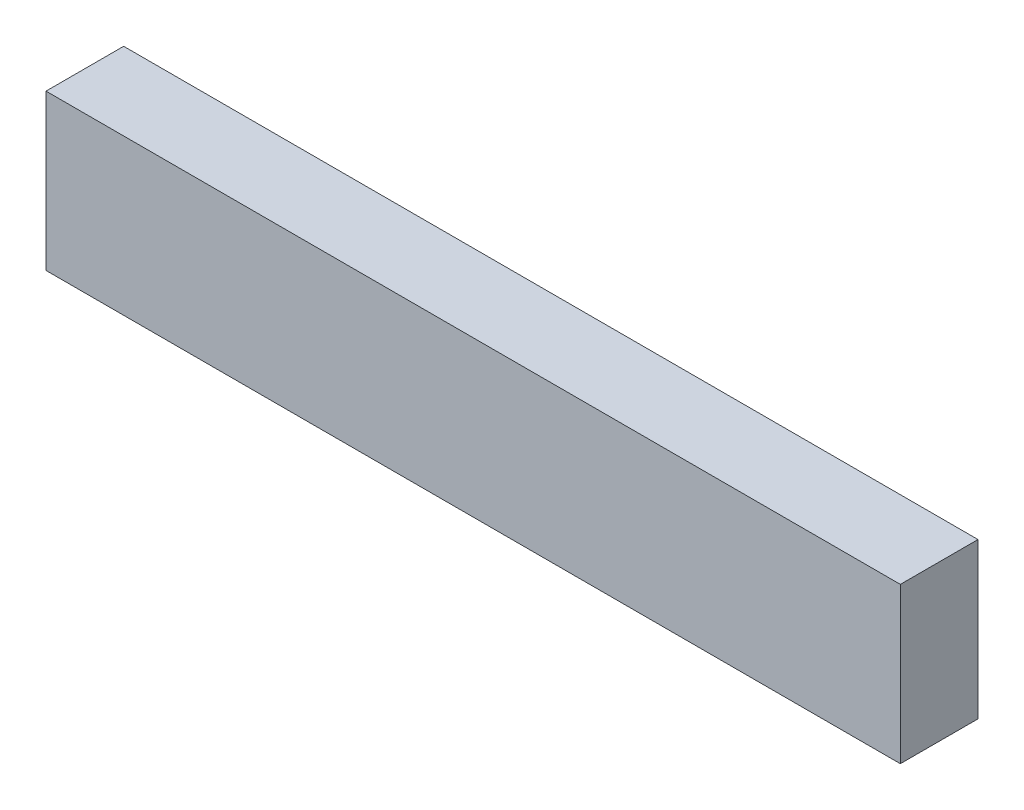
ISO-10303-21;
HEADER;
FILE_DESCRIPTION(('STEP AP214'),'2;1');
FILE_NAME('part.step','',(''),(''),'','','');
FILE_SCHEMA(('AUTOMOTIVE_DESIGN { 1 0 10303 214 1 1 1 1 }'));
ENDSEC;
DATA;
#1=APPLICATION_CONTEXT('core data for automotive mechanical design processes');
#2=APPLICATION_PROTOCOL_DEFINITION('international standard','automotive_design',2000,#1);
#3=PRODUCT_CONTEXT('',#1,'mechanical');
#4=PRODUCT('Part','Part','',(#3));
#5=PRODUCT_RELATED_PRODUCT_CATEGORY('part','',(#4));
#6=PRODUCT_DEFINITION_FORMATION('','',#4);
#7=PRODUCT_DEFINITION_CONTEXT('part definition',#1,'design');
#8=PRODUCT_DEFINITION('design','',#6,#7);
#9=PRODUCT_DEFINITION_SHAPE('','',#8);
#10=(LENGTH_UNIT() NAMED_UNIT(*) SI_UNIT(.MILLI.,.METRE.));
#11=(NAMED_UNIT(*) PLANE_ANGLE_UNIT() SI_UNIT($,.RADIAN.));
#12=(NAMED_UNIT(*) SI_UNIT($,.STERADIAN.) SOLID_ANGLE_UNIT());
#13=UNCERTAINTY_MEASURE_WITH_UNIT(LENGTH_MEASURE(1.E-05),#10,'distance_accuracy_value','');
#14=(GEOMETRIC_REPRESENTATION_CONTEXT(3) GLOBAL_UNCERTAINTY_ASSIGNED_CONTEXT((#13)) GLOBAL_UNIT_ASSIGNED_CONTEXT((#10,
#11,#12)) REPRESENTATION_CONTEXT('',''));
#15=CARTESIAN_POINT('',(0.,0.,0.));
#16=DIRECTION('',(0.,0.,1.));
#17=DIRECTION('',(1.,0.,0.));
#18=AXIS2_PLACEMENT_3D('',#15,#16,#17);
#19=CARTESIAN_POINT('',(0.,0.,10.));
#20=DIRECTION('',(1.,0.,0.));
#21=DIRECTION('',(0.,1.,0.));
#22=AXIS2_PLACEMENT_3D('',#19,#20,#21);
#23=PLANE('',#22);
#24=DIRECTION('',(0.,-1.,0.));
#25=VECTOR('',#24,1.);
#26=CARTESIAN_POINT('',(0.,0.,0.));
#27=LINE('',#26,#25);
#28=CARTESIAN_POINT('',(0.,0.,0.));
#29=VERTEX_POINT('',#28);
#30=CARTESIAN_POINT('',(0.,-20.,0.));
#31=VERTEX_POINT('',#30);
#32=EDGE_CURVE('E96',#29,#31,#27,.T.);
#33=ORIENTED_EDGE('',*,*,#32,.T.);
#34=DIRECTION('',(0.,0.,-1.));
#35=VECTOR('',#34,1.);
#36=CARTESIAN_POINT('',(0.,-20.,10.));
#37=LINE('',#36,#35);
#38=CARTESIAN_POINT('',(0.,-20.,10.));
#39=VERTEX_POINT('',#38);
#40=EDGE_CURVE('E11',#39,#31,#37,.T.);
#41=ORIENTED_EDGE('',*,*,#40,.F.);
#42=DIRECTION('',(0.,-1.,0.));
#43=VECTOR('',#42,1.);
#44=CARTESIAN_POINT('',(0.,0.,10.));
#45=LINE('',#44,#43);
#46=CARTESIAN_POINT('',(0.,0.,10.));
#47=VERTEX_POINT('',#46);
#48=EDGE_CURVE('E84',#47,#39,#45,.T.);
#49=ORIENTED_EDGE('',*,*,#48,.F.);
#50=DIRECTION('',(0.,0.,-1.));
#51=VECTOR('',#50,1.);
#52=CARTESIAN_POINT('',(0.,0.,10.));
#53=LINE('',#52,#51);
#54=EDGE_CURVE('E92',#47,#29,#53,.T.);
#55=ORIENTED_EDGE('',*,*,#54,.T.);
#56=EDGE_LOOP('',(#33,#41,#49,#55));
#57=FACE_BOUND('',#56,.T.);
#58=ADVANCED_FACE('F33',(#57),#23,.F.);
#59=CARTESIAN_POINT('',(0.,-20.,10.));
#60=DIRECTION('',(0.,1.,0.));
#61=DIRECTION('',(0.,0.,1.));
#62=AXIS2_PLACEMENT_3D('',#59,#60,#61);
#63=PLANE('',#62);
#64=DIRECTION('',(1.,0.,0.));
#65=VECTOR('',#64,1.);
#66=CARTESIAN_POINT('',(0.,-20.,0.));
#67=LINE('',#66,#65);
#68=CARTESIAN_POINT('',(110.,-20.,0.));
#69=VERTEX_POINT('',#68);
#70=EDGE_CURVE('E88',#31,#69,#67,.T.);
#71=ORIENTED_EDGE('',*,*,#70,.T.);
#72=DIRECTION('',(0.,0.,-1.));
#73=VECTOR('',#72,1.);
#74=CARTESIAN_POINT('',(110.,-20.,10.));
#75=LINE('',#74,#73);
#76=CARTESIAN_POINT('',(110.,-20.,10.));
#77=VERTEX_POINT('',#76);
#78=EDGE_CURVE('E41',#77,#69,#75,.T.);
#79=ORIENTED_EDGE('',*,*,#78,.F.);
#80=DIRECTION('',(1.,0.,0.));
#81=VECTOR('',#80,1.);
#82=CARTESIAN_POINT('',(0.,-20.,10.));
#83=LINE('',#82,#81);
#84=EDGE_CURVE('E79',#39,#77,#83,.T.);
#85=ORIENTED_EDGE('',*,*,#84,.F.);
#86=ORIENTED_EDGE('',*,*,#40,.T.);
#87=EDGE_LOOP('',(#71,#79,#85,#86));
#88=FACE_BOUND('',#87,.T.);
#89=ADVANCED_FACE('F87',(#88),#63,.F.);
#90=CARTESIAN_POINT('',(110.,0.,10.));
#91=DIRECTION('',(-1.,0.,0.));
#92=DIRECTION('',(0.,0.,1.));
#93=AXIS2_PLACEMENT_3D('',#90,#91,#92);
#94=PLANE('',#93);
#95=DIRECTION('',(0.,1.,0.));
#96=VECTOR('',#95,1.);
#97=CARTESIAN_POINT('',(110.,0.,0.));
#98=LINE('',#97,#96);
#99=CARTESIAN_POINT('',(110.,0.,0.));
#100=VERTEX_POINT('',#99);
#101=EDGE_CURVE('E66',#69,#100,#98,.T.);
#102=ORIENTED_EDGE('',*,*,#101,.T.);
#103=DIRECTION('',(0.,0.,-1.));
#104=VECTOR('',#103,1.);
#105=CARTESIAN_POINT('',(110.,0.,10.));
#106=LINE('',#105,#104);
#107=CARTESIAN_POINT('',(110.,0.,10.));
#108=VERTEX_POINT('',#107);
#109=EDGE_CURVE('E89',#108,#100,#106,.T.);
#110=ORIENTED_EDGE('',*,*,#109,.F.);
#111=DIRECTION('',(0.,1.,0.));
#112=VECTOR('',#111,1.);
#113=CARTESIAN_POINT('',(110.,0.,10.));
#114=LINE('',#113,#112);
#115=EDGE_CURVE('E82',#77,#108,#114,.T.);
#116=ORIENTED_EDGE('',*,*,#115,.F.);
#117=ORIENTED_EDGE('',*,*,#78,.T.);
#118=EDGE_LOOP('',(#102,#110,#116,#117));
#119=FACE_BOUND('',#118,.T.);
#120=ADVANCED_FACE('F90',(#119),#94,.F.);
#121=CARTESIAN_POINT('',(0.,0.,10.));
#122=DIRECTION('',(0.,-1.,0.));
#123=DIRECTION('',(0.,0.,-1.));
#124=AXIS2_PLACEMENT_3D('',#121,#122,#123);
#125=PLANE('',#124);
#126=DIRECTION('',(-1.,0.,0.));
#127=VECTOR('',#126,1.);
#128=CARTESIAN_POINT('',(0.,0.,0.));
#129=LINE('',#128,#127);
#130=EDGE_CURVE('E72',#100,#29,#129,.T.);
#131=ORIENTED_EDGE('',*,*,#130,.T.);
#132=ORIENTED_EDGE('',*,*,#54,.F.);
#133=DIRECTION('',(-1.,0.,0.));
#134=VECTOR('',#133,1.);
#135=CARTESIAN_POINT('',(0.,0.,10.));
#136=LINE('',#135,#134);
#137=EDGE_CURVE('E49',#108,#47,#136,.T.);
#138=ORIENTED_EDGE('',*,*,#137,.F.);
#139=ORIENTED_EDGE('',*,*,#109,.T.);
#140=EDGE_LOOP('',(#131,#132,#138,#139));
#141=FACE_BOUND('',#140,.T.);
#142=ADVANCED_FACE('F103',(#141),#125,.F.);
#143=CARTESIAN_POINT('',(0.,0.,10.));
#144=DIRECTION('',(0.,0.,1.));
#145=DIRECTION('',(1.,0.,0.));
#146=AXIS2_PLACEMENT_3D('',#143,#144,#145);
#147=PLANE('',#146);
#148=ORIENTED_EDGE('',*,*,#48,.T.);
#149=ORIENTED_EDGE('',*,*,#84,.T.);
#150=ORIENTED_EDGE('',*,*,#115,.T.);
#151=ORIENTED_EDGE('',*,*,#137,.T.);
#152=EDGE_LOOP('',(#148,#149,#150,#151));
#153=FACE_BOUND('',#152,.T.);
#154=ADVANCED_FACE('F80',(#153),#147,.T.);
#155=CARTESIAN_POINT('',(0.,0.,0.));
#156=DIRECTION('',(0.,0.,1.));
#157=DIRECTION('',(1.,0.,0.));
#158=AXIS2_PLACEMENT_3D('',#155,#156,#157);
#159=PLANE('',#158);
#160=ORIENTED_EDGE('',*,*,#32,.F.);
#161=ORIENTED_EDGE('',*,*,#130,.F.);
#162=ORIENTED_EDGE('',*,*,#101,.F.);
#163=ORIENTED_EDGE('',*,*,#70,.F.);
#164=EDGE_LOOP('',(#160,#161,#162,#163));
#165=FACE_BOUND('',#164,.T.);
#166=ADVANCED_FACE('F106',(#165),#159,.F.);
#167=CLOSED_SHELL('',(#58,#89,#120,#142,#154,#166));
#168=MANIFOLD_SOLID_BREP('B2',#167);
#169=ADVANCED_BREP_SHAPE_REPRESENTATION('',(#18,#168),#14);
#170=SHAPE_DEFINITION_REPRESENTATION(#9,#169);
ENDSEC;
END-ISO-10303-21;
